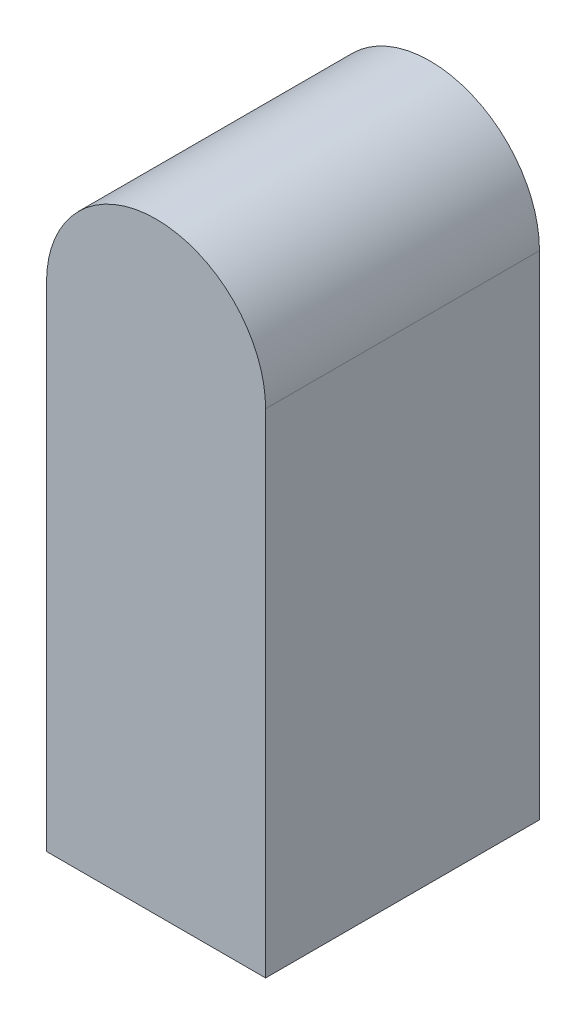
ISO-10303-21;
HEADER;
FILE_DESCRIPTION(('STEP AP214'),'2;1');
FILE_NAME('part.step','',(''),(''),'','','');
FILE_SCHEMA(('AUTOMOTIVE_DESIGN { 1 0 10303 214 1 1 1 1 }'));
ENDSEC;
DATA;
#1=APPLICATION_CONTEXT('core data for automotive mechanical design processes');
#2=APPLICATION_PROTOCOL_DEFINITION('international standard','automotive_design',2000,#1);
#3=PRODUCT_CONTEXT('',#1,'mechanical');
#4=PRODUCT('Part','Part','',(#3));
#5=PRODUCT_RELATED_PRODUCT_CATEGORY('part','',(#4));
#6=PRODUCT_DEFINITION_FORMATION('','',#4);
#7=PRODUCT_DEFINITION_CONTEXT('part definition',#1,'design');
#8=PRODUCT_DEFINITION('design','',#6,#7);
#9=PRODUCT_DEFINITION_SHAPE('','',#8);
#10=(LENGTH_UNIT() NAMED_UNIT(*) SI_UNIT(.MILLI.,.METRE.));
#11=(NAMED_UNIT(*) PLANE_ANGLE_UNIT() SI_UNIT($,.RADIAN.));
#12=(NAMED_UNIT(*) SI_UNIT($,.STERADIAN.) SOLID_ANGLE_UNIT());
#13=UNCERTAINTY_MEASURE_WITH_UNIT(LENGTH_MEASURE(1.E-05),#10,'distance_accuracy_value','');
#14=(GEOMETRIC_REPRESENTATION_CONTEXT(3) GLOBAL_UNCERTAINTY_ASSIGNED_CONTEXT((#13)) GLOBAL_UNIT_ASSIGNED_CONTEXT((#10,
#11,#12)) REPRESENTATION_CONTEXT('',''));
#15=CARTESIAN_POINT('',(0.,0.,0.));
#16=DIRECTION('',(0.,0.,1.));
#17=DIRECTION('',(1.,0.,0.));
#18=AXIS2_PLACEMENT_3D('',#15,#16,#17);
#19=CARTESIAN_POINT('',(0.,0.,100.));
#20=DIRECTION('',(0.,0.,-1.));
#21=DIRECTION('',(-1.,0.,0.));
#22=AXIS2_PLACEMENT_3D('',#19,#20,#21);
#23=CYLINDRICAL_SURFACE('',#22,40.);
#24=CARTESIAN_POINT('',(0.,0.,0.));
#25=DIRECTION('',(0.,0.,1.));
#26=DIRECTION('',(1.,0.,0.));
#27=AXIS2_PLACEMENT_3D('',#24,#25,#26);
#28=CIRCLE('',#27,40.);
#29=CARTESIAN_POINT('',(40.,0.,0.));
#30=VERTEX_POINT('',#29);
#31=CARTESIAN_POINT('',(-40.,0.,0.));
#32=VERTEX_POINT('',#31);
#33=EDGE_CURVE('E107',#30,#32,#28,.T.);
#34=ORIENTED_EDGE('',*,*,#33,.T.);
#35=DIRECTION('',(0.,0.,-1.));
#36=VECTOR('',#35,1.);
#37=CARTESIAN_POINT('',(-40.,0.,100.));
#38=LINE('',#37,#36);
#39=CARTESIAN_POINT('',(-40.,0.,100.));
#40=VERTEX_POINT('',#39);
#41=EDGE_CURVE('E11',#40,#32,#38,.T.);
#42=ORIENTED_EDGE('',*,*,#41,.F.);
#43=CARTESIAN_POINT('',(0.,0.,100.));
#44=DIRECTION('',(0.,0.,1.));
#45=DIRECTION('',(1.,0.,0.));
#46=AXIS2_PLACEMENT_3D('',#43,#44,#45);
#47=CIRCLE('',#46,40.);
#48=CARTESIAN_POINT('',(40.,0.,100.));
#49=VERTEX_POINT('',#48);
#50=EDGE_CURVE('E91',#49,#40,#47,.T.);
#51=ORIENTED_EDGE('',*,*,#50,.F.);
#52=DIRECTION('',(0.,0.,-1.));
#53=VECTOR('',#52,1.);
#54=CARTESIAN_POINT('',(40.,0.,100.));
#55=LINE('',#54,#53);
#56=EDGE_CURVE('E103',#49,#30,#55,.T.);
#57=ORIENTED_EDGE('',*,*,#56,.T.);
#58=EDGE_LOOP('',(#34,#42,#51,#57));
#59=FACE_BOUND('',#58,.T.);
#60=ADVANCED_FACE('F39',(#59),#23,.T.);
#61=CARTESIAN_POINT('',(-40.,0.,100.));
#62=DIRECTION('',(1.,0.,0.));
#63=DIRECTION('',(0.,1.,0.));
#64=AXIS2_PLACEMENT_3D('',#61,#62,#63);
#65=PLANE('',#64);
#66=DIRECTION('',(0.,-1.,0.));
#67=VECTOR('',#66,1.);
#68=CARTESIAN_POINT('',(-40.,0.,0.));
#69=LINE('',#68,#67);
#70=CARTESIAN_POINT('',(-40.,-180.,0.));
#71=VERTEX_POINT('',#70);
#72=EDGE_CURVE('E96',#32,#71,#69,.T.);
#73=ORIENTED_EDGE('',*,*,#72,.T.);
#74=DIRECTION('',(0.,0.,-1.));
#75=VECTOR('',#74,1.);
#76=CARTESIAN_POINT('',(-40.,-180.,100.));
#77=LINE('',#76,#75);
#78=CARTESIAN_POINT('',(-40.,-180.,100.));
#79=VERTEX_POINT('',#78);
#80=EDGE_CURVE('E48',#79,#71,#77,.T.);
#81=ORIENTED_EDGE('',*,*,#80,.F.);
#82=DIRECTION('',(0.,-1.,0.));
#83=VECTOR('',#82,1.);
#84=CARTESIAN_POINT('',(-40.,0.,100.));
#85=LINE('',#84,#83);
#86=EDGE_CURVE('E86',#40,#79,#85,.T.);
#87=ORIENTED_EDGE('',*,*,#86,.F.);
#88=ORIENTED_EDGE('',*,*,#41,.T.);
#89=EDGE_LOOP('',(#73,#81,#87,#88));
#90=FACE_BOUND('',#89,.T.);
#91=ADVANCED_FACE('F95',(#90),#65,.F.);
#92=CARTESIAN_POINT('',(-40.,-180.,100.));
#93=DIRECTION('',(0.,1.,0.));
#94=DIRECTION('',(0.,0.,1.));
#95=AXIS2_PLACEMENT_3D('',#92,#93,#94);
#96=PLANE('',#95);
#97=DIRECTION('',(1.,0.,0.));
#98=VECTOR('',#97,1.);
#99=CARTESIAN_POINT('',(-40.,-180.,0.));
#100=LINE('',#99,#98);
#101=CARTESIAN_POINT('',(40.,-180.,0.));
#102=VERTEX_POINT('',#101);
#103=EDGE_CURVE('E73',#71,#102,#100,.T.);
#104=ORIENTED_EDGE('',*,*,#103,.T.);
#105=DIRECTION('',(0.,0.,-1.));
#106=VECTOR('',#105,1.);
#107=CARTESIAN_POINT('',(40.,-180.,100.));
#108=LINE('',#107,#106);
#109=CARTESIAN_POINT('',(40.,-180.,100.));
#110=VERTEX_POINT('',#109);
#111=EDGE_CURVE('E98',#110,#102,#108,.T.);
#112=ORIENTED_EDGE('',*,*,#111,.F.);
#113=DIRECTION('',(1.,0.,0.));
#114=VECTOR('',#113,1.);
#115=CARTESIAN_POINT('',(-40.,-180.,100.));
#116=LINE('',#115,#114);
#117=EDGE_CURVE('E89',#79,#110,#116,.T.);
#118=ORIENTED_EDGE('',*,*,#117,.F.);
#119=ORIENTED_EDGE('',*,*,#80,.T.);
#120=EDGE_LOOP('',(#104,#112,#118,#119));
#121=FACE_BOUND('',#120,.T.);
#122=ADVANCED_FACE('F99',(#121),#96,.F.);
#123=CARTESIAN_POINT('',(40.,0.,100.));
#124=DIRECTION('',(-1.,0.,0.));
#125=DIRECTION('',(0.,-1.,0.));
#126=AXIS2_PLACEMENT_3D('',#123,#124,#125);
#127=PLANE('',#126);
#128=DIRECTION('',(0.,1.,0.));
#129=VECTOR('',#128,1.);
#130=CARTESIAN_POINT('',(40.,0.,0.));
#131=LINE('',#130,#129);
#132=EDGE_CURVE('E79',#102,#30,#131,.T.);
#133=ORIENTED_EDGE('',*,*,#132,.T.);
#134=ORIENTED_EDGE('',*,*,#56,.F.);
#135=DIRECTION('',(0.,1.,0.));
#136=VECTOR('',#135,1.);
#137=CARTESIAN_POINT('',(40.,0.,100.));
#138=LINE('',#137,#136);
#139=EDGE_CURVE('E56',#110,#49,#138,.T.);
#140=ORIENTED_EDGE('',*,*,#139,.F.);
#141=ORIENTED_EDGE('',*,*,#111,.T.);
#142=EDGE_LOOP('',(#133,#134,#140,#141));
#143=FACE_BOUND('',#142,.T.);
#144=ADVANCED_FACE('F120',(#143),#127,.F.);
#145=CARTESIAN_POINT('',(0.,0.,100.));
#146=DIRECTION('',(0.,0.,1.));
#147=DIRECTION('',(1.,0.,0.));
#148=AXIS2_PLACEMENT_3D('',#145,#146,#147);
#149=PLANE('',#148);
#150=ORIENTED_EDGE('',*,*,#50,.T.);
#151=ORIENTED_EDGE('',*,*,#86,.T.);
#152=ORIENTED_EDGE('',*,*,#117,.T.);
#153=ORIENTED_EDGE('',*,*,#139,.T.);
#154=EDGE_LOOP('',(#150,#151,#152,#153));
#155=FACE_BOUND('',#154,.T.);
#156=ADVANCED_FACE('F87',(#155),#149,.T.);
#157=CARTESIAN_POINT('',(0.,0.,0.));
#158=DIRECTION('',(0.,0.,1.));
#159=DIRECTION('',(1.,0.,0.));
#160=AXIS2_PLACEMENT_3D('',#157,#158,#159);
#161=PLANE('',#160);
#162=ORIENTED_EDGE('',*,*,#33,.F.);
#163=ORIENTED_EDGE('',*,*,#132,.F.);
#164=ORIENTED_EDGE('',*,*,#103,.F.);
#165=ORIENTED_EDGE('',*,*,#72,.F.);
#166=EDGE_LOOP('',(#162,#163,#164,#165));
#167=FACE_BOUND('',#166,.T.);
#168=ADVANCED_FACE('F123',(#167),#161,.F.);
#169=CLOSED_SHELL('',(#60,#91,#122,#144,#156,#168));
#170=MANIFOLD_SOLID_BREP('B2',#169);
#171=ADVANCED_BREP_SHAPE_REPRESENTATION('',(#18,#170),#14);
#172=SHAPE_DEFINITION_REPRESENTATION(#9,#171);
ENDSEC;
END-ISO-10303-21;
